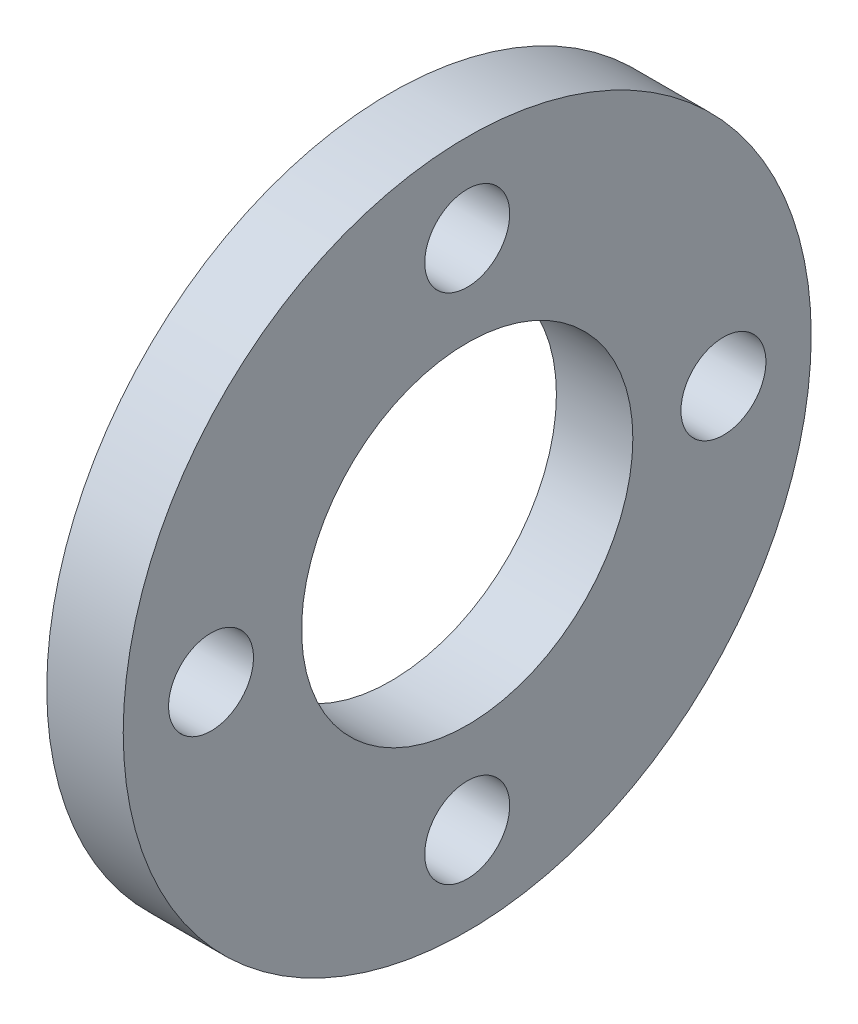
ISO-10303-21;
HEADER;
FILE_DESCRIPTION(('STEP AP214'),'2;1');
FILE_NAME('part.step','',(''),(''),'','','');
FILE_SCHEMA(('AUTOMOTIVE_DESIGN { 1 0 10303 214 1 1 1 1 }'));
ENDSEC;
DATA;
#1=APPLICATION_CONTEXT('core data for automotive mechanical design processes');
#2=APPLICATION_PROTOCOL_DEFINITION('international standard','automotive_design',2000,#1);
#3=PRODUCT_CONTEXT('',#1,'mechanical');
#4=PRODUCT('Part','Part','',(#3));
#5=PRODUCT_RELATED_PRODUCT_CATEGORY('part','',(#4));
#6=PRODUCT_DEFINITION_FORMATION('','',#4);
#7=PRODUCT_DEFINITION_CONTEXT('part definition',#1,'design');
#8=PRODUCT_DEFINITION('design','',#6,#7);
#9=PRODUCT_DEFINITION_SHAPE('','',#8);
#10=(LENGTH_UNIT() NAMED_UNIT(*) SI_UNIT(.MILLI.,.METRE.));
#11=(NAMED_UNIT(*) PLANE_ANGLE_UNIT() SI_UNIT($,.RADIAN.));
#12=(NAMED_UNIT(*) SI_UNIT($,.STERADIAN.) SOLID_ANGLE_UNIT());
#13=UNCERTAINTY_MEASURE_WITH_UNIT(LENGTH_MEASURE(1.E-05),#10,'distance_accuracy_value','');
#14=(GEOMETRIC_REPRESENTATION_CONTEXT(3) GLOBAL_UNCERTAINTY_ASSIGNED_CONTEXT((#13)) GLOBAL_UNIT_ASSIGNED_CONTEXT((#10,
#11,#12)) REPRESENTATION_CONTEXT('',''));
#15=CARTESIAN_POINT('',(0.,0.,0.));
#16=DIRECTION('',(0.,0.,1.));
#17=DIRECTION('',(1.,0.,0.));
#18=AXIS2_PLACEMENT_3D('',#15,#16,#17);
#19=CARTESIAN_POINT('',(18.,0.,60.325));
#20=DIRECTION('',(-1.,0.,0.));
#21=DIRECTION('',(0.,0.,1.));
#22=AXIS2_PLACEMENT_3D('',#19,#20,#21);
#23=CYLINDRICAL_SURFACE('',#22,10.);
#24=CARTESIAN_POINT('',(18.,0.,60.325));
#25=DIRECTION('',(-1.,0.,0.));
#26=DIRECTION('',(0.,0.,1.));
#27=AXIS2_PLACEMENT_3D('',#24,#25,#26);
#28=CIRCLE('',#27,10.);
#29=CARTESIAN_POINT('',(18.,0.,70.325));
#30=VERTEX_POINT('',#29);
#31=EDGE_CURVE('E39',#30,#30,#28,.T.);
#32=ORIENTED_EDGE('',*,*,#31,.F.);
#33=EDGE_LOOP('',(#32));
#34=FACE_BOUND('',#33,.T.);
#35=CARTESIAN_POINT('',(0.,0.,60.325));
#36=DIRECTION('',(-1.,0.,0.));
#37=DIRECTION('',(0.,0.,1.));
#38=AXIS2_PLACEMENT_3D('',#35,#36,#37);
#39=CIRCLE('',#38,10.);
#40=CARTESIAN_POINT('',(0.,0.,70.325));
#41=VERTEX_POINT('',#40);
#42=EDGE_CURVE('E16',#41,#41,#39,.F.);
#43=ORIENTED_EDGE('',*,*,#42,.F.);
#44=EDGE_LOOP('',(#43));
#45=FACE_BOUND('',#44,.T.);
#46=ADVANCED_FACE('F13',(#34,#45),#23,.F.);
#47=CARTESIAN_POINT('',(18.,-60.325,0.));
#48=DIRECTION('',(-1.,0.,0.));
#49=DIRECTION('',(0.,0.,1.));
#50=AXIS2_PLACEMENT_3D('',#47,#48,#49);
#51=CYLINDRICAL_SURFACE('',#50,10.);
#52=CARTESIAN_POINT('',(18.,-60.325,0.));
#53=DIRECTION('',(-1.,0.,0.));
#54=DIRECTION('',(0.,0.,1.));
#55=AXIS2_PLACEMENT_3D('',#52,#53,#54);
#56=CIRCLE('',#55,10.);
#57=CARTESIAN_POINT('',(18.,-60.325,10.));
#58=VERTEX_POINT('',#57);
#59=EDGE_CURVE('E36',#58,#58,#56,.T.);
#60=ORIENTED_EDGE('',*,*,#59,.F.);
#61=EDGE_LOOP('',(#60));
#62=FACE_BOUND('',#61,.T.);
#63=CARTESIAN_POINT('',(0.,-60.325,0.));
#64=DIRECTION('',(-1.,0.,0.));
#65=DIRECTION('',(0.,0.,1.));
#66=AXIS2_PLACEMENT_3D('',#63,#64,#65);
#67=CIRCLE('',#66,10.);
#68=CARTESIAN_POINT('',(0.,-60.325,10.));
#69=VERTEX_POINT('',#68);
#70=EDGE_CURVE('E50',#69,#69,#67,.F.);
#71=ORIENTED_EDGE('',*,*,#70,.F.);
#72=EDGE_LOOP('',(#71));
#73=FACE_BOUND('',#72,.T.);
#74=ADVANCED_FACE('F61',(#62,#73),#51,.F.);
#75=CARTESIAN_POINT('',(18.,0.,-60.325));
#76=DIRECTION('',(-1.,0.,0.));
#77=DIRECTION('',(0.,0.,1.));
#78=AXIS2_PLACEMENT_3D('',#75,#76,#77);
#79=CYLINDRICAL_SURFACE('',#78,10.);
#80=CARTESIAN_POINT('',(18.,0.,-60.325));
#81=DIRECTION('',(-1.,0.,0.));
#82=DIRECTION('',(0.,0.,1.));
#83=AXIS2_PLACEMENT_3D('',#80,#81,#82);
#84=CIRCLE('',#83,10.);
#85=CARTESIAN_POINT('',(18.,0.,-50.325));
#86=VERTEX_POINT('',#85);
#87=EDGE_CURVE('E33',#86,#86,#84,.T.);
#88=ORIENTED_EDGE('',*,*,#87,.F.);
#89=EDGE_LOOP('',(#88));
#90=FACE_BOUND('',#89,.T.);
#91=CARTESIAN_POINT('',(0.,0.,-60.325));
#92=DIRECTION('',(-1.,0.,0.));
#93=DIRECTION('',(0.,0.,1.));
#94=AXIS2_PLACEMENT_3D('',#91,#92,#93);
#95=CIRCLE('',#94,10.);
#96=CARTESIAN_POINT('',(0.,0.,-50.325));
#97=VERTEX_POINT('',#96);
#98=EDGE_CURVE('E48',#97,#97,#95,.F.);
#99=ORIENTED_EDGE('',*,*,#98,.F.);
#100=EDGE_LOOP('',(#99));
#101=FACE_BOUND('',#100,.T.);
#102=ADVANCED_FACE('F67',(#90,#101),#79,.F.);
#103=CARTESIAN_POINT('',(18.,60.325,0.));
#104=DIRECTION('',(-1.,0.,0.));
#105=DIRECTION('',(0.,0.,1.));
#106=AXIS2_PLACEMENT_3D('',#103,#104,#105);
#107=CYLINDRICAL_SURFACE('',#106,9.99999999999998);
#108=CARTESIAN_POINT('',(18.,60.325,0.));
#109=DIRECTION('',(-1.,0.,0.));
#110=DIRECTION('',(0.,0.,1.));
#111=AXIS2_PLACEMENT_3D('',#108,#109,#110);
#112=CIRCLE('',#111,9.99999999999998);
#113=CARTESIAN_POINT('',(18.,60.325,9.99999999999998));
#114=VERTEX_POINT('',#113);
#115=EDGE_CURVE('E30',#114,#114,#112,.T.);
#116=ORIENTED_EDGE('',*,*,#115,.F.);
#117=EDGE_LOOP('',(#116));
#118=FACE_BOUND('',#117,.T.);
#119=CARTESIAN_POINT('',(0.,60.325,0.));
#120=DIRECTION('',(-1.,0.,0.));
#121=DIRECTION('',(0.,0.,1.));
#122=AXIS2_PLACEMENT_3D('',#119,#120,#121);
#123=CIRCLE('',#122,9.99999999999998);
#124=CARTESIAN_POINT('',(0.,60.325,9.99999999999998));
#125=VERTEX_POINT('',#124);
#126=EDGE_CURVE('E45',#125,#125,#123,.F.);
#127=ORIENTED_EDGE('',*,*,#126,.F.);
#128=EDGE_LOOP('',(#127));
#129=FACE_BOUND('',#128,.T.);
#130=ADVANCED_FACE('F87',(#118,#129),#107,.F.);
#131=CARTESIAN_POINT('',(0.,0.,0.));
#132=DIRECTION('',(1.,0.,0.));
#133=DIRECTION('',(0.,0.,-1.));
#134=AXIS2_PLACEMENT_3D('',#131,#132,#133);
#135=CYLINDRICAL_SURFACE('',#134,39.);
#136=CARTESIAN_POINT('',(0.,0.,0.));
#137=DIRECTION('',(1.,0.,0.));
#138=DIRECTION('',(0.,0.,-1.));
#139=AXIS2_PLACEMENT_3D('',#136,#137,#138);
#140=CIRCLE('',#139,39.);
#141=CARTESIAN_POINT('',(0.,0.,-39.));
#142=VERTEX_POINT('',#141);
#143=EDGE_CURVE('E42',#142,#142,#140,.T.);
#144=ORIENTED_EDGE('',*,*,#143,.F.);
#145=EDGE_LOOP('',(#144));
#146=FACE_BOUND('',#145,.T.);
#147=CARTESIAN_POINT('',(18.,0.,0.));
#148=DIRECTION('',(1.,0.,0.));
#149=DIRECTION('',(0.,0.,-1.));
#150=AXIS2_PLACEMENT_3D('',#147,#148,#149);
#151=CIRCLE('',#150,39.);
#152=CARTESIAN_POINT('',(18.,0.,-39.));
#153=VERTEX_POINT('',#152);
#154=EDGE_CURVE('E25',#153,#153,#151,.F.);
#155=ORIENTED_EDGE('',*,*,#154,.F.);
#156=EDGE_LOOP('',(#155));
#157=FACE_BOUND('',#156,.T.);
#158=ADVANCED_FACE('F83',(#146,#157),#135,.F.);
#159=CARTESIAN_POINT('',(0.,-81.97200316244,-81.));
#160=DIRECTION('',(-1.,0.,0.));
#161=DIRECTION('',(0.,0.,1.));
#162=AXIS2_PLACEMENT_3D('',#159,#160,#161);
#163=PLANE('',#162);
#164=ORIENTED_EDGE('',*,*,#143,.T.);
#165=EDGE_LOOP('',(#164));
#166=FACE_BOUND('',#165,.T.);
#167=ORIENTED_EDGE('',*,*,#126,.T.);
#168=EDGE_LOOP('',(#167));
#169=FACE_BOUND('',#168,.T.);
#170=ORIENTED_EDGE('',*,*,#98,.T.);
#171=EDGE_LOOP('',(#170));
#172=FACE_BOUND('',#171,.T.);
#173=ORIENTED_EDGE('',*,*,#70,.T.);
#174=EDGE_LOOP('',(#173));
#175=FACE_BOUND('',#174,.T.);
#176=ORIENTED_EDGE('',*,*,#42,.T.);
#177=EDGE_LOOP('',(#176));
#178=FACE_BOUND('',#177,.T.);
#179=CARTESIAN_POINT('',(0.,0.,0.));
#180=DIRECTION('',(1.,0.,0.));
#181=DIRECTION('',(0.,0.,-1.));
#182=AXIS2_PLACEMENT_3D('',#179,#180,#181);
#183=CIRCLE('',#182,81.);
#184=CARTESIAN_POINT('',(0.,0.,-81.));
#185=VERTEX_POINT('',#184);
#186=EDGE_CURVE('E20',#185,#185,#183,.T.);
#187=ORIENTED_EDGE('',*,*,#186,.F.);
#188=EDGE_LOOP('',(#187));
#189=FACE_BOUND('',#188,.T.);
#190=ADVANCED_FACE('F57',(#166,#169,#172,#175,#178,#189),#163,.T.);
#191=CARTESIAN_POINT('',(18.,-81.9720031624379,81.));
#192=DIRECTION('',(1.,0.,0.));
#193=DIRECTION('',(0.,0.,-1.));
#194=AXIS2_PLACEMENT_3D('',#191,#192,#193);
#195=PLANE('',#194);
#196=ORIENTED_EDGE('',*,*,#154,.T.);
#197=EDGE_LOOP('',(#196));
#198=FACE_BOUND('',#197,.T.);
#199=ORIENTED_EDGE('',*,*,#115,.T.);
#200=EDGE_LOOP('',(#199));
#201=FACE_BOUND('',#200,.T.);
#202=ORIENTED_EDGE('',*,*,#87,.T.);
#203=EDGE_LOOP('',(#202));
#204=FACE_BOUND('',#203,.T.);
#205=ORIENTED_EDGE('',*,*,#59,.T.);
#206=EDGE_LOOP('',(#205));
#207=FACE_BOUND('',#206,.T.);
#208=ORIENTED_EDGE('',*,*,#31,.T.);
#209=EDGE_LOOP('',(#208));
#210=FACE_BOUND('',#209,.T.);
#211=CARTESIAN_POINT('',(18.,0.,0.));
#212=DIRECTION('',(1.,0.,0.));
#213=DIRECTION('',(0.,0.,-1.));
#214=AXIS2_PLACEMENT_3D('',#211,#212,#213);
#215=CIRCLE('',#214,81.);
#216=CARTESIAN_POINT('',(18.,0.,-81.));
#217=VERTEX_POINT('',#216);
#218=EDGE_CURVE('E8',#217,#217,#215,.F.);
#219=ORIENTED_EDGE('',*,*,#218,.F.);
#220=EDGE_LOOP('',(#219));
#221=FACE_BOUND('',#220,.T.);
#222=ADVANCED_FACE('F72',(#198,#201,#204,#207,#210,#221),#195,.T.);
#223=CARTESIAN_POINT('',(18.,0.,0.));
#224=DIRECTION('',(1.,0.,0.));
#225=DIRECTION('',(0.,0.,-1.));
#226=AXIS2_PLACEMENT_3D('',#223,#224,#225);
#227=CYLINDRICAL_SURFACE('',#226,81.);
#228=ORIENTED_EDGE('',*,*,#186,.T.);
#229=EDGE_LOOP('',(#228));
#230=FACE_BOUND('',#229,.T.);
#231=ORIENTED_EDGE('',*,*,#218,.T.);
#232=EDGE_LOOP('',(#231));
#233=FACE_BOUND('',#232,.T.);
#234=ADVANCED_FACE('F70',(#230,#233),#227,.T.);
#235=CLOSED_SHELL('',(#46,#74,#102,#130,#158,#190,#222,#234));
#236=MANIFOLD_SOLID_BREP('B1',#235);
#237=ADVANCED_BREP_SHAPE_REPRESENTATION('',(#18,#236),#14);
#238=SHAPE_DEFINITION_REPRESENTATION(#9,#237);
ENDSEC;
END-ISO-10303-21;
